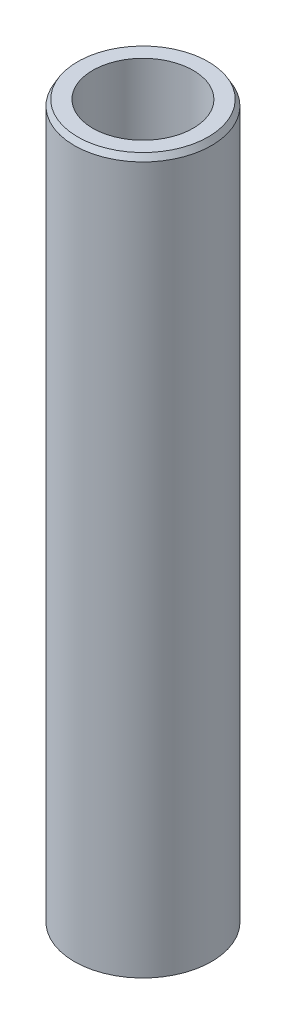
ISO-10303-21;
HEADER;
FILE_DESCRIPTION(('STEP AP214'),'2;1');
FILE_NAME('part.step','',(''),(''),'','','');
FILE_SCHEMA(('AUTOMOTIVE_DESIGN { 1 0 10303 214 1 1 1 1 }'));
ENDSEC;
DATA;
#1=APPLICATION_CONTEXT('core data for automotive mechanical design processes');
#2=APPLICATION_PROTOCOL_DEFINITION('international standard','automotive_design',2000,#1);
#3=PRODUCT_CONTEXT('',#1,'mechanical');
#4=PRODUCT('Part','Part','',(#3));
#5=PRODUCT_RELATED_PRODUCT_CATEGORY('part','',(#4));
#6=PRODUCT_DEFINITION_FORMATION('','',#4);
#7=PRODUCT_DEFINITION_CONTEXT('part definition',#1,'design');
#8=PRODUCT_DEFINITION('design','',#6,#7);
#9=PRODUCT_DEFINITION_SHAPE('','',#8);
#10=(LENGTH_UNIT() NAMED_UNIT(*) SI_UNIT(.MILLI.,.METRE.));
#11=(NAMED_UNIT(*) PLANE_ANGLE_UNIT() SI_UNIT($,.RADIAN.));
#12=(NAMED_UNIT(*) SI_UNIT($,.STERADIAN.) SOLID_ANGLE_UNIT());
#13=UNCERTAINTY_MEASURE_WITH_UNIT(LENGTH_MEASURE(1.E-05),#10,'distance_accuracy_value','');
#14=(GEOMETRIC_REPRESENTATION_CONTEXT(3) GLOBAL_UNCERTAINTY_ASSIGNED_CONTEXT((#13)) GLOBAL_UNIT_ASSIGNED_CONTEXT((#10,
#11,#12)) REPRESENTATION_CONTEXT('',''));
#15=CARTESIAN_POINT('',(0.,0.,0.));
#16=DIRECTION('',(0.,0.,1.));
#17=DIRECTION('',(1.,0.,0.));
#18=AXIS2_PLACEMENT_3D('',#15,#16,#17);
#19=CARTESIAN_POINT('',(0.,600.,0.));
#20=DIRECTION('',(0.,-1.,0.));
#21=DIRECTION('',(0.,0.,-1.));
#22=AXIS2_PLACEMENT_3D('',#19,#20,#21);
#23=CYLINDRICAL_SURFACE('',#22,57.5);
#24=CARTESIAN_POINT('',(0.,595.141439618099,0.));
#25=DIRECTION('',(0.,1.,0.));
#26=DIRECTION('',(0.,0.,1.));
#27=AXIS2_PLACEMENT_3D('',#24,#25,#26);
#28=CIRCLE('',#27,57.5);
#29=CARTESIAN_POINT('',(0.,595.141439618099,57.5));
#30=VERTEX_POINT('',#29);
#31=EDGE_CURVE('E50',#30,#30,#28,.F.);
#32=ORIENTED_EDGE('',*,*,#31,.T.);
#33=EDGE_LOOP('',(#32));
#34=FACE_BOUND('',#33,.T.);
#35=CARTESIAN_POINT('',(0.,2.80509114436467,0.));
#36=DIRECTION('',(0.,1.,0.));
#37=DIRECTION('',(0.,0.,1.));
#38=AXIS2_PLACEMENT_3D('',#35,#36,#37);
#39=CIRCLE('',#38,57.5);
#40=CARTESIAN_POINT('',(0.,2.80509114436467,57.5));
#41=VERTEX_POINT('',#40);
#42=EDGE_CURVE('E51',#41,#41,#39,.T.);
#43=ORIENTED_EDGE('',*,*,#42,.T.);
#44=EDGE_LOOP('',(#43));
#45=FACE_BOUND('',#44,.T.);
#46=ADVANCED_FACE('F39',(#34,#45),#23,.T.);
#47=CARTESIAN_POINT('',(0.,600.,0.));
#48=DIRECTION('',(0.,1.,0.));
#49=DIRECTION('',(0.,0.,1.));
#50=AXIS2_PLACEMENT_3D('',#47,#48,#49);
#51=PLANE('',#50);
#52=CARTESIAN_POINT('',(0.,600.,0.));
#53=DIRECTION('',(0.,1.,0.));
#54=DIRECTION('',(0.,0.,1.));
#55=AXIS2_PLACEMENT_3D('',#52,#53,#54);
#56=CIRCLE('',#55,54.6949088556354);
#57=CARTESIAN_POINT('',(0.,600.,54.6949088556354));
#58=VERTEX_POINT('',#57);
#59=EDGE_CURVE('E54',#58,#58,#56,.T.);
#60=ORIENTED_EDGE('',*,*,#59,.T.);
#61=EDGE_LOOP('',(#60));
#62=FACE_BOUND('',#61,.T.);
#63=CARTESIAN_POINT('',(0.,600.,0.));
#64=DIRECTION('',(0.,1.,0.));
#65=DIRECTION('',(0.,0.,1.));
#66=AXIS2_PLACEMENT_3D('',#63,#64,#65);
#67=CIRCLE('',#66,42.0864636157943);
#68=CARTESIAN_POINT('',(0.,600.,42.0864636157943));
#69=VERTEX_POINT('',#68);
#70=EDGE_CURVE('E58',#69,#69,#67,.T.);
#71=ORIENTED_EDGE('',*,*,#70,.F.);
#72=EDGE_LOOP('',(#71));
#73=FACE_BOUND('',#72,.T.);
#74=ADVANCED_FACE('F69',(#62,#73),#51,.T.);
#75=CARTESIAN_POINT('',(0.,0.,0.));
#76=DIRECTION('',(0.,1.,0.));
#77=DIRECTION('',(0.,0.,1.));
#78=AXIS2_PLACEMENT_3D('',#75,#76,#77);
#79=PLANE('',#78);
#80=CARTESIAN_POINT('',(0.,0.,0.));
#81=DIRECTION('',(0.,1.,0.));
#82=DIRECTION('',(0.,0.,1.));
#83=AXIS2_PLACEMENT_3D('',#80,#81,#82);
#84=CIRCLE('',#83,52.641439618099);
#85=CARTESIAN_POINT('',(0.,0.,52.641439618099));
#86=VERTEX_POINT('',#85);
#87=EDGE_CURVE('E10',#86,#86,#84,.F.);
#88=ORIENTED_EDGE('',*,*,#87,.T.);
#89=EDGE_LOOP('',(#88));
#90=FACE_BOUND('',#89,.T.);
#91=CARTESIAN_POINT('',(0.,0.,0.));
#92=DIRECTION('',(0.,1.,0.));
#93=DIRECTION('',(0.,0.,1.));
#94=AXIS2_PLACEMENT_3D('',#91,#92,#93);
#95=CIRCLE('',#94,42.0864636157943);
#96=CARTESIAN_POINT('',(0.,0.,42.0864636157943));
#97=VERTEX_POINT('',#96);
#98=EDGE_CURVE('E63',#97,#97,#95,.T.);
#99=ORIENTED_EDGE('',*,*,#98,.T.);
#100=EDGE_LOOP('',(#99));
#101=FACE_BOUND('',#100,.T.);
#102=ADVANCED_FACE('F75',(#90,#101),#79,.F.);
#103=CARTESIAN_POINT('',(0.,600.,0.));
#104=DIRECTION('',(0.,-1.,0.));
#105=DIRECTION('',(0.,0.,-1.));
#106=AXIS2_PLACEMENT_3D('',#103,#104,#105);
#107=CYLINDRICAL_SURFACE('',#106,42.0864636157943);
#108=ORIENTED_EDGE('',*,*,#70,.T.);
#109=EDGE_LOOP('',(#108));
#110=FACE_BOUND('',#109,.T.);
#111=ORIENTED_EDGE('',*,*,#98,.F.);
#112=EDGE_LOOP('',(#111));
#113=FACE_BOUND('',#112,.T.);
#114=ADVANCED_FACE('F70',(#110,#113),#107,.F.);
#115=CARTESIAN_POINT('',(0.,600.,0.));
#116=DIRECTION('',(0.,-1.,0.));
#117=DIRECTION('',(0.,0.,-1.));
#118=AXIS2_PLACEMENT_3D('',#115,#116,#117);
#119=CONICAL_SURFACE('',#118,54.6949088556354,0.523598775598291);
#120=ORIENTED_EDGE('',*,*,#31,.F.);
#121=EDGE_LOOP('',(#120));
#122=FACE_BOUND('',#121,.T.);
#123=ORIENTED_EDGE('',*,*,#59,.F.);
#124=EDGE_LOOP('',(#123));
#125=FACE_BOUND('',#124,.T.);
#126=ADVANCED_FACE('F81',(#122,#125),#119,.T.);
#127=CARTESIAN_POINT('',(0.,2.80509114436467,0.));
#128=DIRECTION('',(0.,1.,0.));
#129=DIRECTION('',(0.,0.,1.));
#130=AXIS2_PLACEMENT_3D('',#127,#128,#129);
#131=CONICAL_SURFACE('',#130,57.5,1.04719755119659);
#132=ORIENTED_EDGE('',*,*,#87,.F.);
#133=EDGE_LOOP('',(#132));
#134=FACE_BOUND('',#133,.T.);
#135=ORIENTED_EDGE('',*,*,#42,.F.);
#136=EDGE_LOOP('',(#135));
#137=FACE_BOUND('',#136,.T.);
#138=ADVANCED_FACE('F45',(#134,#137),#131,.T.);
#139=CLOSED_SHELL('',(#46,#74,#102,#114,#126,#138));
#140=MANIFOLD_SOLID_BREP('B2',#139);
#141=ADVANCED_BREP_SHAPE_REPRESENTATION('',(#18,#140),#14);
#142=SHAPE_DEFINITION_REPRESENTATION(#9,#141);
ENDSEC;
END-ISO-10303-21;
